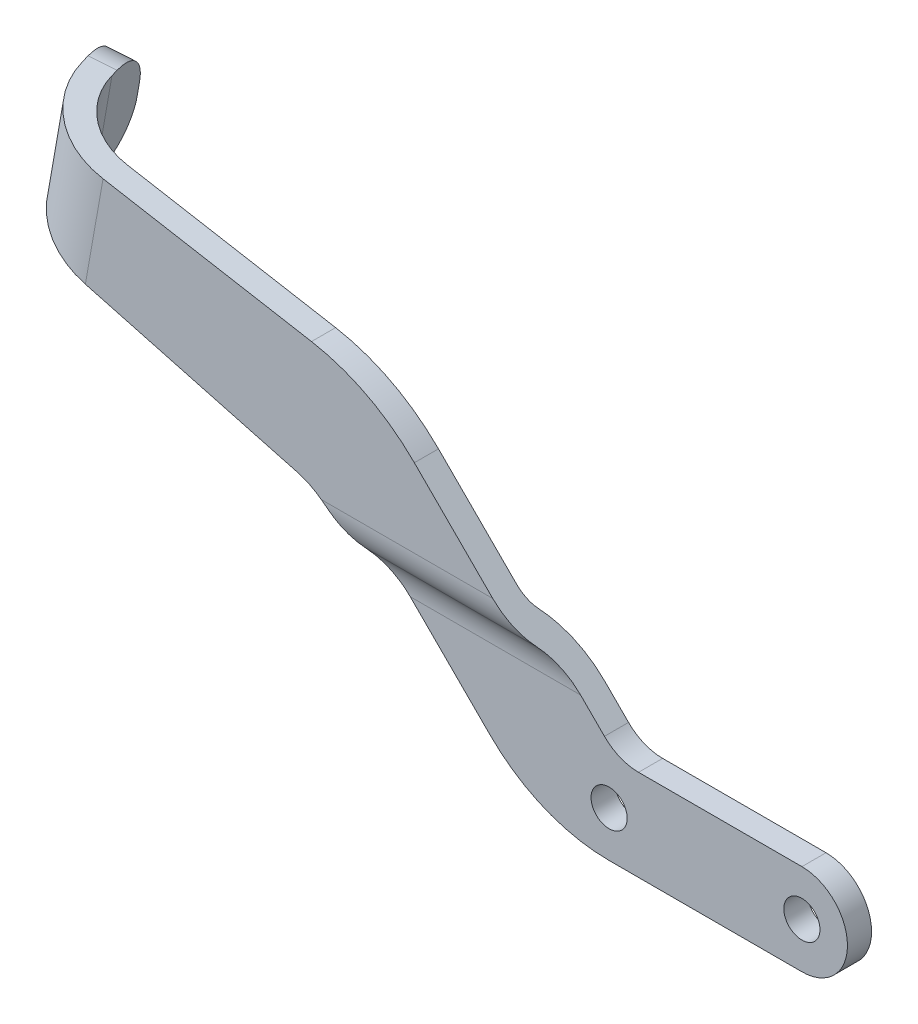
ISO-10303-21;
HEADER;
FILE_DESCRIPTION(('STEP AP214'),'2;1');
FILE_NAME('part.step','',(''),(''),'','','');
FILE_SCHEMA(('AUTOMOTIVE_DESIGN { 1 0 10303 214 1 1 1 1 }'));
ENDSEC;
DATA;
#1=APPLICATION_CONTEXT('core data for automotive mechanical design processes');
#2=APPLICATION_PROTOCOL_DEFINITION('international standard','automotive_design',2000,#1);
#3=PRODUCT_CONTEXT('',#1,'mechanical');
#4=PRODUCT('Part','Part','',(#3));
#5=PRODUCT_RELATED_PRODUCT_CATEGORY('part','',(#4));
#6=PRODUCT_DEFINITION_FORMATION('','',#4);
#7=PRODUCT_DEFINITION_CONTEXT('part definition',#1,'design');
#8=PRODUCT_DEFINITION('design','',#6,#7);
#9=PRODUCT_DEFINITION_SHAPE('','',#8);
#10=(LENGTH_UNIT() NAMED_UNIT(*) SI_UNIT(.MILLI.,.METRE.));
#11=(NAMED_UNIT(*) PLANE_ANGLE_UNIT() SI_UNIT($,.RADIAN.));
#12=(NAMED_UNIT(*) SI_UNIT($,.STERADIAN.) SOLID_ANGLE_UNIT());
#13=UNCERTAINTY_MEASURE_WITH_UNIT(LENGTH_MEASURE(1.E-05),#10,'distance_accuracy_value','');
#14=(GEOMETRIC_REPRESENTATION_CONTEXT(3) GLOBAL_UNCERTAINTY_ASSIGNED_CONTEXT((#13)) GLOBAL_UNIT_ASSIGNED_CONTEXT((#10,
#11,#12)) REPRESENTATION_CONTEXT('',''));
#15=CARTESIAN_POINT('',(0.,0.,0.));
#16=DIRECTION('',(0.,0.,1.));
#17=DIRECTION('',(1.,0.,0.));
#18=AXIS2_PLACEMENT_3D('',#15,#16,#17);
#19=CARTESIAN_POINT('',(-26.0151280605346,7.85987193946543,-3.175));
#20=DIRECTION('',(-0.707106781186549,-0.707106781186546,0.));
#21=DIRECTION('',(0.707106781186546,-0.707106781186549,0.));
#22=AXIS2_PLACEMENT_3D('',#19,#20,#21);
#23=PLANE('',#22);
#24=CARTESIAN_POINT('',(-29.1549957084391,10.9997395873699,6.35));
#25=DIRECTION('',(0.707106781186549,0.707106781186546,0.));
#26=DIRECTION('',(0.707106781186546,-0.707106781186549,0.));
#27=AXIS2_PLACEMENT_3D('',#24,#25,#26);
#28=ELLIPSE('',#27,13.4703841816037,9.525);
#29=CARTESIAN_POINT('',(-29.1549957084391,10.9997395873699,-3.175));
#30=VERTEX_POINT('',#29);
#31=CARTESIAN_POINT('',(-35.4551910179116,17.2999348968425,-0.793750000000002));
#32=VERTEX_POINT('',#31);
#33=EDGE_CURVE('E258',#30,#32,#28,.T.);
#34=ORIENTED_EDGE('',*,*,#33,.T.);
#35=CARTESIAN_POINT('',(-37.5552561210691,19.4,-3.175));
#36=DIRECTION('',(0.707106781186549,0.707106781186546,0.));
#37=DIRECTION('',(0.707106781186546,-0.707106781186549,0.));
#38=AXIS2_PLACEMENT_3D('',#35,#36,#37);
#39=ELLIPSE('',#38,4.49012806053457,3.175);
#40=CARTESIAN_POINT('',(-37.5552561210691,19.4,0.));
#41=VERTEX_POINT('',#40);
#42=EDGE_CURVE('E270',#32,#41,#39,.F.);
#43=ORIENTED_EDGE('',*,*,#42,.T.);
#44=DIRECTION('',(0.707106781186546,-0.707106781186549,0.));
#45=VECTOR('',#44,1.);
#46=CARTESIAN_POINT('',(-26.0151280605346,7.85987193946543,0.));
#47=LINE('',#46,#45);
#48=CARTESIAN_POINT('',(-47.8835482141741,29.728292093105,0.));
#49=VERTEX_POINT('',#48);
#50=EDGE_CURVE('E552',#49,#41,#47,.T.);
#51=ORIENTED_EDGE('',*,*,#50,.F.);
#52=DIRECTION('',(0.,0.,1.));
#53=VECTOR('',#52,1.);
#54=CARTESIAN_POINT('',(-47.8835482141741,29.728292093105,-3.175));
#55=LINE('',#54,#53);
#56=CARTESIAN_POINT('',(-47.8835482141741,29.728292093105,3.175));
#57=VERTEX_POINT('',#56);
#58=EDGE_CURVE('E450',#49,#57,#55,.T.);
#59=ORIENTED_EDGE('',*,*,#58,.T.);
#60=DIRECTION('',(-0.707106781186546,0.707106781186549,0.));
#61=VECTOR('',#60,1.);
#62=CARTESIAN_POINT('',(-26.0151280605346,7.85987193946543,3.175));
#63=LINE('',#62,#61);
#64=CARTESIAN_POINT('',(-37.5552561210691,19.4,3.175));
#65=VERTEX_POINT('',#64);
#66=EDGE_CURVE('E438',#65,#57,#63,.T.);
#67=ORIENTED_EDGE('',*,*,#66,.F.);
#68=CARTESIAN_POINT('',(-37.5552561210691,19.4,-3.175));
#69=DIRECTION('',(0.707106781186549,0.707106781186546,0.));
#70=DIRECTION('',(-0.707106781186546,0.707106781186549,0.));
#71=AXIS2_PLACEMENT_3D('',#68,#69,#70);
#72=ELLIPSE('',#71,8.98025612106914,6.35);
#73=CARTESIAN_POINT('',(-33.3551259147541,15.199869793685,1.5875));
#74=VERTEX_POINT('',#73);
#75=EDGE_CURVE('E295',#74,#65,#72,.F.);
#76=ORIENTED_EDGE('',*,*,#75,.F.);
#77=CARTESIAN_POINT('',(-29.1549957084391,10.9997395873699,6.35));
#78=DIRECTION('',(0.707106781186549,0.707106781186546,0.));
#79=DIRECTION('',(-0.707106781186546,0.707106781186549,0.));
#80=AXIS2_PLACEMENT_3D('',#77,#78,#79);
#81=ELLIPSE('',#80,8.98025612106914,6.35);
#82=CARTESIAN_POINT('',(-29.1549957084391,10.9997395873699,0.));
#83=VERTEX_POINT('',#82);
#84=EDGE_CURVE('E430',#83,#74,#81,.T.);
#85=ORIENTED_EDGE('',*,*,#84,.F.);
#86=DIRECTION('',(-0.707106781186546,0.707106781186549,0.));
#87=VECTOR('',#86,1.);
#88=CARTESIAN_POINT('',(-26.0151280605346,7.85987193946543,0.));
#89=LINE('',#88,#87);
#90=CARTESIAN_POINT('',(-26.0151280605346,7.85987193946543,0.));
#91=VERTEX_POINT('',#90);
#92=EDGE_CURVE('E526',#91,#83,#89,.T.);
#93=ORIENTED_EDGE('',*,*,#92,.F.);
#94=DIRECTION('',(0.,0.,1.));
#95=VECTOR('',#94,1.);
#96=CARTESIAN_POINT('',(-26.0151280605346,7.85987193946543,-3.175));
#97=LINE('',#96,#95);
#98=CARTESIAN_POINT('',(-26.0151280605346,7.85987193946543,-3.175));
#99=VERTEX_POINT('',#98);
#100=EDGE_CURVE('E411',#99,#91,#97,.T.);
#101=ORIENTED_EDGE('',*,*,#100,.F.);
#102=DIRECTION('',(-0.707106781186546,0.707106781186549,0.));
#103=VECTOR('',#102,1.);
#104=CARTESIAN_POINT('',(-26.0151280605346,7.85987193946543,-3.175));
#105=LINE('',#104,#103);
#106=EDGE_CURVE('E408',#99,#30,#105,.T.);
#107=ORIENTED_EDGE('',*,*,#106,.T.);
#108=EDGE_LOOP('',(#34,#43,#51,#59,#67,#76,#85,#93,#101,#107));
#109=FACE_BOUND('',#108,.T.);
#110=ADVANCED_FACE('F45',(#109),#23,.F.);
#111=CARTESIAN_POINT('',(-65.8440604563124,11.7677798509667,-3.175));
#112=DIRECTION('',(0.,0.,1.));
#113=DIRECTION('',(-1.,0.,0.));
#114=AXIS2_PLACEMENT_3D('',#111,#112,#113);
#115=CYLINDRICAL_SURFACE('',#114,9.52500000000001);
#116=DIRECTION('',(0.,0.,1.));
#117=VECTOR('',#116,1.);
#118=CARTESIAN_POINT('',(-59.1088683655106,18.5029719417686,-3.175));
#119=LINE('',#118,#117);
#120=CARTESIAN_POINT('',(-59.1088683655106,18.5029719417686,-0.129352997679215));
#121=VERTEX_POINT('',#120);
#122=CARTESIAN_POINT('',(-59.1088683655106,18.5029719417686,3.1113217116805));
#123=VERTEX_POINT('',#122);
#124=EDGE_CURVE('E458',#121,#123,#119,.T.);
#125=ORIENTED_EDGE('',*,*,#124,.T.);
#126=CARTESIAN_POINT('',(-59.1088683655106,18.5029719417686,3.1113217116805));
#127=CARTESIAN_POINT('',(-59.189505151597,18.583613825167,3.12282841350219));
#128=CARTESIAN_POINT('',(-59.2717146733717,18.6629219050843,3.13256262496471));
#129=CARTESIAN_POINT('',(-59.4389441454381,18.818532451764,3.14880457763691));
#130=CARTESIAN_POINT('',(-59.5239583882968,18.8948404041585,3.15531848630597));
#131=CARTESIAN_POINT('',(-59.6967706565378,19.044421600127,3.16547983513595));
#132=CARTESIAN_POINT('',(-59.7845685842799,19.1176949499349,3.16912737572188));
#133=CARTESIAN_POINT('',(-59.9629595247646,19.2612047935532,3.17388938858678));
#134=CARTESIAN_POINT('',(-60.0535575957453,19.3314351657777,3.17499896803526));
#135=CARTESIAN_POINT('',(-60.1453903836823,19.4,3.175));
#136=B_SPLINE_CURVE_WITH_KNOTS('',3,(#126,#127,#128,#129,#130,#131,#132,#133,#134,#135),
.UNSPECIFIED.,.F.,.F.,(4,2,2,2,4),(0.,0.343814559628881,0.686968076684379,1.03010957060628,
1.37391203728518),.UNSPECIFIED.);
#137=CARTESIAN_POINT('',(-60.1453903836823,19.4,3.175));
#138=VERTEX_POINT('',#137);
#139=EDGE_CURVE('E287',#123,#138,#136,.T.);
#140=ORIENTED_EDGE('',*,*,#139,.T.);
#141=CARTESIAN_POINT('',(-65.8440604563124,11.7677798509667,3.175));
#142=DIRECTION('',(0.,0.,1.));
#143=DIRECTION('',(1.,0.,0.));
#144=AXIS2_PLACEMENT_3D('',#141,#142,#143);
#145=CIRCLE('',#144,9.52500000000001);
#146=CARTESIAN_POINT('',(-63.3788090517109,20.9682233463701,3.175));
#147=VERTEX_POINT('',#146);
#148=EDGE_CURVE('E427',#138,#147,#145,.T.);
#149=ORIENTED_EDGE('',*,*,#148,.T.);
#150=DIRECTION('',(0.,0.,1.));
#151=VECTOR('',#150,1.);
#152=CARTESIAN_POINT('',(-63.3788090517109,20.9682233463701,-3.175));
#153=LINE('',#152,#151);
#154=CARTESIAN_POINT('',(-63.3788090517109,20.9682233463701,0.));
#155=VERTEX_POINT('',#154);
#156=EDGE_CURVE('E456',#155,#147,#153,.T.);
#157=ORIENTED_EDGE('',*,*,#156,.F.);
#158=CARTESIAN_POINT('',(-65.8440604563124,11.7677798509667,0.));
#159=DIRECTION('',(0.,0.,-1.));
#160=DIRECTION('',(-1.,0.,0.));
#161=AXIS2_PLACEMENT_3D('',#158,#159,#160);
#162=CIRCLE('',#161,9.52500000000001);
#163=CARTESIAN_POINT('',(-60.1453903836823,19.4,0.));
#164=VERTEX_POINT('',#163);
#165=EDGE_CURVE('E477',#155,#164,#162,.T.);
#166=ORIENTED_EDGE('',*,*,#165,.T.);
#167=CARTESIAN_POINT('',(-59.1088683655106,18.5029719417686,-0.129352997679214));
#168=CARTESIAN_POINT('',(-59.1886792418234,18.5828004142644,-0.105848736286279));
#169=CARTESIAN_POINT('',(-59.2704318916558,18.6616980958661,-0.0860128643272615));
#170=CARTESIAN_POINT('',(-59.4371062268742,18.8168516372428,-0.053007404663316));
#171=CARTESIAN_POINT('',(-59.5220143189027,18.893116595117,-0.0398121361289758));
#172=CARTESIAN_POINT('',(-59.6948995496534,19.0428422283832,-0.0192473264905239));
#173=CARTESIAN_POINT('',(-59.7828761994638,19.1163033466386,-0.0118768617102921));
#174=CARTESIAN_POINT('',(-59.9619463224182,19.2604195171152,-0.00224620935788169));
#175=CARTESIAN_POINT('',(-60.0530506400862,19.3310624707226,-6.12148140675001E-06));
#176=CARTESIAN_POINT('',(-60.1453903836823,19.4,0.));
#177=B_SPLINE_CURVE_WITH_KNOTS('',3,(#167,#168,#169,#170,#171,#172,#173,#174,#175,#176),
.UNSPECIFIED.,.F.,.F.,(4,2,2,2,4),(0.,0.345762616395283,0.690177606879254,1.03453797032589,
1.38024517136542),.UNSPECIFIED.);
#178=EDGE_CURVE('E261',#121,#164,#177,.T.);
#179=ORIENTED_EDGE('',*,*,#178,.F.);
#180=EDGE_LOOP('',(#125,#140,#149,#157,#166,#179));
#181=FACE_BOUND('',#180,.T.);
#182=ADVANCED_FACE('F276',(#181),#115,.F.);
#183=CARTESIAN_POINT('',(-59.1088683655106,18.5029719417686,-3.175));
#184=DIRECTION('',(0.707106781186549,0.707106781186546,0.));
#185=DIRECTION('',(-0.707106781186546,0.707106781186549,0.));
#186=AXIS2_PLACEMENT_3D('',#183,#184,#185);
#187=PLANE('',#186);
#188=CARTESIAN_POINT('',(-60.005896423742,19.4,-3.175));
#189=DIRECTION('',(-0.707106781186549,-0.707106781186546,0.));
#190=DIRECTION('',(0.707106781186546,-0.707106781186549,0.));
#191=AXIS2_PLACEMENT_3D('',#188,#189,#190);
#192=ELLIPSE('',#191,4.49012806053456,3.175);
#193=CARTESIAN_POINT('',(-57.9058313205844,17.2999348968425,-0.793750000000002));
#194=VERTEX_POINT('',#193);
#195=EDGE_CURVE('E474',#121,#194,#192,.F.);
#196=ORIENTED_EDGE('',*,*,#195,.T.);
#197=CARTESIAN_POINT('',(-51.6056360111119,10.9997395873699,6.35));
#198=DIRECTION('',(-0.707106781186549,-0.707106781186546,0.));
#199=DIRECTION('',(0.707106781186546,-0.707106781186549,0.));
#200=AXIS2_PLACEMENT_3D('',#197,#198,#199);
#201=ELLIPSE('',#200,13.4703841816037,9.525);
#202=CARTESIAN_POINT('',(-51.6056360111119,10.9997395873699,-3.175));
#203=VERTEX_POINT('',#202);
#204=EDGE_CURVE('E255',#194,#203,#201,.T.);
#205=ORIENTED_EDGE('',*,*,#204,.T.);
#206=DIRECTION('',(0.707106781186546,-0.707106781186549,0.));
#207=VECTOR('',#206,1.);
#208=CARTESIAN_POINT('',(-59.1088683655106,18.5029719417686,-3.175));
#209=LINE('',#208,#207);
#210=CARTESIAN_POINT('',(-41.115448211871,0.509551788129007,-3.175));
#211=VERTEX_POINT('',#210);
#212=EDGE_CURVE('E415',#203,#211,#209,.T.);
#213=ORIENTED_EDGE('',*,*,#212,.T.);
#214=DIRECTION('',(0.,0.,1.));
#215=VECTOR('',#214,1.);
#216=CARTESIAN_POINT('',(-41.115448211871,0.509551788129007,-3.175));
#217=LINE('',#216,#215);
#218=CARTESIAN_POINT('',(-41.115448211871,0.509551788129007,0.));
#219=VERTEX_POINT('',#218);
#220=EDGE_CURVE('E461',#211,#219,#217,.T.);
#221=ORIENTED_EDGE('',*,*,#220,.T.);
#222=DIRECTION('',(0.707106781186546,-0.707106781186549,0.));
#223=VECTOR('',#222,1.);
#224=CARTESIAN_POINT('',(-59.1088683655106,18.5029719417686,0.));
#225=LINE('',#224,#223);
#226=CARTESIAN_POINT('',(-51.6056360111119,10.9997395873699,0.));
#227=VERTEX_POINT('',#226);
#228=EDGE_CURVE('E519',#227,#219,#225,.T.);
#229=ORIENTED_EDGE('',*,*,#228,.F.);
#230=CARTESIAN_POINT('',(-51.6056360111119,10.9997395873699,6.35));
#231=DIRECTION('',(-0.707106781186549,-0.707106781186546,0.));
#232=DIRECTION('',(-0.707106781186546,0.707106781186549,0.));
#233=AXIS2_PLACEMENT_3D('',#230,#231,#232);
#234=ELLIPSE('',#233,8.98025612106913,6.35);
#235=CARTESIAN_POINT('',(-55.8057662174269,15.199869793685,1.5875));
#236=VERTEX_POINT('',#235);
#237=EDGE_CURVE('E470',#236,#227,#234,.T.);
#238=ORIENTED_EDGE('',*,*,#237,.F.);
#239=CARTESIAN_POINT('',(-60.005896423742,19.4,-3.175));
#240=DIRECTION('',(-0.707106781186549,-0.707106781186546,0.));
#241=DIRECTION('',(-0.707106781186546,0.707106781186549,0.));
#242=AXIS2_PLACEMENT_3D('',#239,#240,#241);
#243=ELLIPSE('',#242,8.98025612106913,6.35);
#244=EDGE_CURVE('E296',#123,#236,#243,.F.);
#245=ORIENTED_EDGE('',*,*,#244,.F.);
#246=ORIENTED_EDGE('',*,*,#124,.F.);
#247=EDGE_LOOP('',(#196,#205,#213,#221,#229,#238,#245,#246));
#248=FACE_BOUND('',#247,.T.);
#249=ADVANCED_FACE('F281',(#248),#187,.F.);
#250=CARTESIAN_POINT('',(0.,0.,-3.175));
#251=DIRECTION('',(0.,0.,1.));
#252=DIRECTION('',(-1.,0.,0.));
#253=AXIS2_PLACEMENT_3D('',#250,#251,#252);
#254=PLANE('',#253);
#255=CARTESIAN_POINT('',(-25.4,0.,-3.175));
#256=DIRECTION('',(0.,0.,1.));
#257=DIRECTION('',(1.,0.,0.));
#258=AXIS2_PLACEMENT_3D('',#255,#256,#257);
#259=CIRCLE('',#258,2.38125);
#260=CARTESIAN_POINT('',(-23.01875,0.,-3.175));
#261=VERTEX_POINT('',#260);
#262=EDGE_CURVE('E223',#261,#261,#259,.T.);
#263=ORIENTED_EDGE('',*,*,#262,.T.);
#264=EDGE_LOOP('',(#263));
#265=FACE_BOUND('',#264,.T.);
#266=CARTESIAN_POINT('',(0.,0.,-3.175));
#267=DIRECTION('',(0.,0.,1.));
#268=DIRECTION('',(1.,0.,0.));
#269=AXIS2_PLACEMENT_3D('',#266,#267,#268);
#270=CIRCLE('',#269,2.38125);
#271=CARTESIAN_POINT('',(2.38125,0.,-3.175));
#272=VERTEX_POINT('',#271);
#273=EDGE_CURVE('E247',#272,#272,#270,.T.);
#274=ORIENTED_EDGE('',*,*,#273,.T.);
#275=EDGE_LOOP('',(#274));
#276=FACE_BOUND('',#275,.T.);
#277=DIRECTION('',(1.,0.,0.));
#278=VECTOR('',#277,1.);
#279=CARTESIAN_POINT('',(-91.2266301851405,10.9997395873699,-3.175));
#280=LINE('',#279,#278);
#281=EDGE_CURVE('E400',#203,#30,#280,.T.);
#282=ORIENTED_EDGE('',*,*,#281,.T.);
#283=ORIENTED_EDGE('',*,*,#106,.F.);
#284=CARTESIAN_POINT('',(-21.525,12.35,-3.175));
#285=DIRECTION('',(0.,0.,1.));
#286=DIRECTION('',(1.,0.,0.));
#287=AXIS2_PLACEMENT_3D('',#284,#285,#286);
#288=CIRCLE('',#287,6.35);
#289=CARTESIAN_POINT('',(-21.525,6.,-3.175));
#290=VERTEX_POINT('',#289);
#291=EDGE_CURVE('E414',#99,#290,#288,.T.);
#292=ORIENTED_EDGE('',*,*,#291,.T.);
#293=DIRECTION('',(-1.,0.,0.));
#294=VECTOR('',#293,1.);
#295=CARTESIAN_POINT('',(0.,6.,-3.175));
#296=LINE('',#295,#294);
#297=CARTESIAN_POINT('',(0.,6.,-3.175));
#298=VERTEX_POINT('',#297);
#299=EDGE_CURVE('E417',#298,#290,#296,.T.);
#300=ORIENTED_EDGE('',*,*,#299,.F.);
#301=CARTESIAN_POINT('',(0.,0.,-3.175));
#302=DIRECTION('',(0.,0.,-1.));
#303=DIRECTION('',(-1.,0.,0.));
#304=AXIS2_PLACEMENT_3D('',#301,#302,#303);
#305=CIRCLE('',#304,6.);
#306=CARTESIAN_POINT('',(0.,-6.,-3.175));
#307=VERTEX_POINT('',#306);
#308=EDGE_CURVE('E441',#298,#307,#305,.T.);
#309=ORIENTED_EDGE('',*,*,#308,.T.);
#310=DIRECTION('',(-1.,0.,0.));
#311=VECTOR('',#310,1.);
#312=CARTESIAN_POINT('',(0.,-6.,-3.175));
#313=LINE('',#312,#311);
#314=CARTESIAN_POINT('',(-25.4,-6.,-3.175));
#315=VERTEX_POINT('',#314);
#316=EDGE_CURVE('E531',#307,#315,#313,.T.);
#317=ORIENTED_EDGE('',*,*,#316,.T.);
#318=CARTESIAN_POINT('',(-25.4,16.225,-3.175));
#319=DIRECTION('',(0.,0.,-1.));
#320=DIRECTION('',(-1.,0.,0.));
#321=AXIS2_PLACEMENT_3D('',#318,#319,#320);
#322=CIRCLE('',#321,22.225);
#323=EDGE_CURVE('E420',#315,#211,#322,.T.);
#324=ORIENTED_EDGE('',*,*,#323,.T.);
#325=ORIENTED_EDGE('',*,*,#212,.F.);
#326=EDGE_LOOP('',(#282,#283,#292,#300,#309,#317,#324,#325));
#327=FACE_BOUND('',#326,.T.);
#328=ADVANCED_FACE('F314',(#265,#276,#327),#254,.F.);
#329=CARTESIAN_POINT('',(0.,0.,-3.175));
#330=DIRECTION('',(0.,0.,1.));
#331=DIRECTION('',(-1.,0.,0.));
#332=AXIS2_PLACEMENT_3D('',#329,#330,#331);
#333=CYLINDRICAL_SURFACE('',#332,6.);
#334=CARTESIAN_POINT('',(0.,0.,0.));
#335=DIRECTION('',(0.,0.,1.));
#336=DIRECTION('',(1.,0.,0.));
#337=AXIS2_PLACEMENT_3D('',#334,#335,#336);
#338=CIRCLE('',#337,6.);
#339=CARTESIAN_POINT('',(0.,6.,0.));
#340=VERTEX_POINT('',#339);
#341=CARTESIAN_POINT('',(0.,-6.,0.));
#342=VERTEX_POINT('',#341);
#343=EDGE_CURVE('E537',#340,#342,#338,.F.);
#344=ORIENTED_EDGE('',*,*,#343,.T.);
#345=DIRECTION('',(0.,0.,1.));
#346=VECTOR('',#345,1.);
#347=CARTESIAN_POINT('',(0.,-6.,-3.175));
#348=LINE('',#347,#346);
#349=EDGE_CURVE('E426',#307,#342,#348,.T.);
#350=ORIENTED_EDGE('',*,*,#349,.F.);
#351=ORIENTED_EDGE('',*,*,#308,.F.);
#352=DIRECTION('',(0.,0.,1.));
#353=VECTOR('',#352,1.);
#354=CARTESIAN_POINT('',(0.,6.,-3.175));
#355=LINE('',#354,#353);
#356=EDGE_CURVE('E442',#298,#340,#355,.T.);
#357=ORIENTED_EDGE('',*,*,#356,.T.);
#358=EDGE_LOOP('',(#344,#350,#351,#357));
#359=FACE_BOUND('',#358,.T.);
#360=ADVANCED_FACE('F317',(#359),#333,.T.);
#361=CARTESIAN_POINT('',(0.,6.,-3.175));
#362=DIRECTION('',(0.,-1.,0.));
#363=DIRECTION('',(1.,0.,0.));
#364=AXIS2_PLACEMENT_3D('',#361,#362,#363);
#365=PLANE('',#364);
#366=ORIENTED_EDGE('',*,*,#356,.F.);
#367=ORIENTED_EDGE('',*,*,#299,.T.);
#368=DIRECTION('',(0.,0.,1.));
#369=VECTOR('',#368,1.);
#370=CARTESIAN_POINT('',(-21.525,6.,-3.175));
#371=LINE('',#370,#369);
#372=CARTESIAN_POINT('',(-21.525,6.,0.));
#373=VERTEX_POINT('',#372);
#374=EDGE_CURVE('E446',#290,#373,#371,.T.);
#375=ORIENTED_EDGE('',*,*,#374,.T.);
#376=DIRECTION('',(-1.,0.,0.));
#377=VECTOR('',#376,1.);
#378=CARTESIAN_POINT('',(0.,6.,0.));
#379=LINE('',#378,#377);
#380=EDGE_CURVE('E540',#340,#373,#379,.T.);
#381=ORIENTED_EDGE('',*,*,#380,.F.);
#382=EDGE_LOOP('',(#366,#367,#375,#381));
#383=FACE_BOUND('',#382,.T.);
#384=ADVANCED_FACE('F323',(#383),#365,.F.);
#385=CARTESIAN_POINT('',(-21.525,12.35,-3.175));
#386=DIRECTION('',(0.,0.,1.));
#387=DIRECTION('',(-1.,0.,0.));
#388=AXIS2_PLACEMENT_3D('',#385,#386,#387);
#389=CYLINDRICAL_SURFACE('',#388,6.35);
#390=CARTESIAN_POINT('',(-21.525,12.35,0.));
#391=DIRECTION('',(0.,0.,1.));
#392=DIRECTION('',(1.,0.,0.));
#393=AXIS2_PLACEMENT_3D('',#390,#391,#392);
#394=CIRCLE('',#393,6.35);
#395=EDGE_CURVE('E542',#91,#373,#394,.T.);
#396=ORIENTED_EDGE('',*,*,#395,.T.);
#397=ORIENTED_EDGE('',*,*,#374,.F.);
#398=ORIENTED_EDGE('',*,*,#291,.F.);
#399=ORIENTED_EDGE('',*,*,#100,.T.);
#400=EDGE_LOOP('',(#396,#397,#398,#399));
#401=FACE_BOUND('',#400,.T.);
#402=ADVANCED_FACE('F326',(#401),#389,.F.);
#403=CARTESIAN_POINT('',(-65.8440604563124,11.7677798509667,-3.175));
#404=DIRECTION('',(0.,0.,1.));
#405=DIRECTION('',(-1.,0.,0.));
#406=AXIS2_PLACEMENT_3D('',#403,#404,#405);
#407=CYLINDRICAL_SURFACE('',#406,25.4);
#408=DIRECTION('',(0.,0.,1.));
#409=VECTOR('',#408,1.);
#410=CARTESIAN_POINT('',(-61.4333967435724,36.7818967774768,-3.175));
#411=LINE('',#410,#409);
#412=CARTESIAN_POINT('',(-61.4333967435724,36.7818967774768,0.));
#413=VERTEX_POINT('',#412);
#414=CARTESIAN_POINT('',(-61.4333967435724,36.7818967774768,3.175));
#415=VERTEX_POINT('',#414);
#416=EDGE_CURVE('E453',#413,#415,#411,.T.);
#417=ORIENTED_EDGE('',*,*,#416,.T.);
#418=CARTESIAN_POINT('',(-65.8440604563124,11.7677798509667,3.175));
#419=DIRECTION('',(0.,0.,1.));
#420=DIRECTION('',(1.,0.,0.));
#421=AXIS2_PLACEMENT_3D('',#418,#419,#420);
#422=CIRCLE('',#421,25.4);
#423=EDGE_CURVE('E435',#57,#415,#422,.T.);
#424=ORIENTED_EDGE('',*,*,#423,.F.);
#425=ORIENTED_EDGE('',*,*,#58,.F.);
#426=CARTESIAN_POINT('',(-65.8440604563124,11.7677798509667,0.));
#427=DIRECTION('',(0.,0.,-1.));
#428=DIRECTION('',(-1.,0.,0.));
#429=AXIS2_PLACEMENT_3D('',#426,#427,#428);
#430=CIRCLE('',#429,25.4);
#431=EDGE_CURVE('E557',#413,#49,#430,.T.);
#432=ORIENTED_EDGE('',*,*,#431,.F.);
#433=EDGE_LOOP('',(#417,#424,#425,#432));
#434=FACE_BOUND('',#433,.T.);
#435=ADVANCED_FACE('F330',(#434),#407,.T.);
#436=CARTESIAN_POINT('',(-61.4333967435724,36.7818967774768,-3.175));
#437=DIRECTION('',(-0.17364817766693,-0.984807753012208,0.));
#438=DIRECTION('',(0.984807753012208,-0.17364817766693,0.));
#439=AXIS2_PLACEMENT_3D('',#436,#437,#438);
#440=PLANE('',#439);
#441=DIRECTION('',(-0.241580615484602,0.0425971805260925,-0.969445349895139));
#442=VECTOR('',#441,1.);
#443=CARTESIAN_POINT('',(-101.437156596784,43.8356389693801,-6.73547247011678));
#444=LINE('',#443,#442);
#445=CARTESIAN_POINT('',(-101.437156596784,43.8356389693801,-6.73547247011678));
#446=VERTEX_POINT('',#445);
#447=CARTESIAN_POINT('',(-101.658057911583,43.8745898312532,-7.6219332980609));
#448=VERTEX_POINT('',#447);
#449=EDGE_CURVE('E347',#446,#448,#444,.T.);
#450=ORIENTED_EDGE('',*,*,#449,.F.);
#451=CARTESIAN_POINT('',(-88.9,41.625,-9.9568));
#452=DIRECTION('',(-0.17364817766693,-0.984807753012208,0.));
#453=DIRECTION('',(-0.984807753012208,0.17364817766693,0.));
#454=AXIS2_PLACEMENT_3D('',#451,#452,#453);
#455=CIRCLE('',#454,13.1318);
#456=CARTESIAN_POINT('',(-88.9,41.625,3.175));
#457=VERTEX_POINT('',#456);
#458=EDGE_CURVE('E243',#457,#446,#455,.T.);
#459=ORIENTED_EDGE('',*,*,#458,.F.);
#460=DIRECTION('',(-0.984807753012208,0.17364817766693,0.));
#461=VECTOR('',#460,1.);
#462=CARTESIAN_POINT('',(-61.4333967435724,36.7818967774768,3.175));
#463=LINE('',#462,#461);
#464=EDGE_CURVE('E433',#415,#457,#463,.T.);
#465=ORIENTED_EDGE('',*,*,#464,.F.);
#466=ORIENTED_EDGE('',*,*,#416,.F.);
#467=DIRECTION('',(0.984807753012208,-0.17364817766693,0.));
#468=VECTOR('',#467,1.);
#469=CARTESIAN_POINT('',(-61.4333967435724,36.7818967774768,0.));
#470=LINE('',#469,#468);
#471=CARTESIAN_POINT('',(-88.9,41.625,0.));
#472=VERTEX_POINT('',#471);
#473=EDGE_CURVE('E559',#472,#413,#470,.T.);
#474=ORIENTED_EDGE('',*,*,#473,.F.);
#475=CARTESIAN_POINT('',(-88.9,41.625,-9.9568));
#476=DIRECTION('',(-0.17364817766693,-0.984807753012208,0.));
#477=DIRECTION('',(-0.984807753012208,0.17364817766693,0.));
#478=AXIS2_PLACEMENT_3D('',#475,#476,#477);
#479=CIRCLE('',#478,9.95679999999999);
#480=CARTESIAN_POINT('',(-98.4059291797663,43.3011517910967,-7.51432342028197));
#481=VERTEX_POINT('',#480);
#482=EDGE_CURVE('E228',#472,#481,#479,.T.);
#483=ORIENTED_EDGE('',*,*,#482,.T.);
#484=DIRECTION('',(0.241580615484602,-0.0425971805260914,0.969445349895139));
#485=VECTOR('',#484,1.);
#486=CARTESIAN_POINT('',(-99.9154214975603,43.567316013896,-13.5718057445668));
#487=LINE('',#486,#485);
#488=CARTESIAN_POINT('',(-98.6268304945654,43.3401026529698,-8.40078424822609));
#489=VERTEX_POINT('',#488);
#490=EDGE_CURVE('E211',#489,#481,#487,.T.);
#491=ORIENTED_EDGE('',*,*,#490,.F.);
#492=DIRECTION('',(0.954717296698367,-0.168342418356971,-0.245307385878799));
#493=VECTOR('',#492,1.);
#494=CARTESIAN_POINT('',(-98.6268304945654,43.3401026529698,-8.40078424822608));
#495=LINE('',#494,#493);
#496=EDGE_CURVE('E350',#448,#489,#495,.T.);
#497=ORIENTED_EDGE('',*,*,#496,.F.);
#498=EDGE_LOOP('',(#450,#459,#465,#466,#474,#483,#491,#497));
#499=FACE_BOUND('',#498,.T.);
#500=ADVANCED_FACE('F336',(#499),#440,.F.);
#501=CARTESIAN_POINT('',(-63.3788090517109,20.9682233463701,-3.175));
#502=DIRECTION('',(-0.258819045102521,-0.965925826289068,0.));
#503=DIRECTION('',(0.965925826289068,-0.258819045102521,0.));
#504=AXIS2_PLACEMENT_3D('',#501,#502,#503);
#505=PLANE('',#504);
#506=DIRECTION('',(0.237799086154686,-0.0637180730960073,0.969222163275752));
#507=VECTOR('',#506,1.);
#508=CARTESIAN_POINT('',(-101.957856591592,31.3054479794431,-13.1060863516145));
#509=LINE('',#508,#507);
#510=CARTESIAN_POINT('',(-100.830533645396,31.0033827064008,-8.51134041591392));
#511=VERTEX_POINT('',#510);
#512=CARTESIAN_POINT('',(-100.585915084837,30.9378373606455,-7.51432342028197));
#513=VERTEX_POINT('',#512);
#514=EDGE_CURVE('E209',#511,#513,#509,.T.);
#515=ORIENTED_EDGE('',*,*,#514,.T.);
#516=CARTESIAN_POINT('',(-91.2266301851405,28.4300245300389,-9.9568));
#517=DIRECTION('',(0.258819045102521,0.965925826289068,0.));
#518=DIRECTION('',(-0.965925826289068,0.258819045102521,0.));
#519=AXIS2_PLACEMENT_3D('',#516,#517,#518);
#520=ELLIPSE('',#519,9.9948333584516,9.95679999999999);
#521=CARTESIAN_POINT('',(-91.2266301851405,28.4300245300389,0.));
#522=VERTEX_POINT('',#521);
#523=EDGE_CURVE('E218',#522,#513,#520,.F.);
#524=ORIENTED_EDGE('',*,*,#523,.F.);
#525=DIRECTION('',(0.965925826289068,-0.258819045102521,0.));
#526=VECTOR('',#525,1.);
#527=CARTESIAN_POINT('',(-63.3788090517109,20.9682233463701,0.));
#528=LINE('',#527,#526);
#529=EDGE_CURVE('E561',#522,#155,#528,.T.);
#530=ORIENTED_EDGE('',*,*,#529,.T.);
#531=ORIENTED_EDGE('',*,*,#156,.T.);
#532=DIRECTION('',(-0.965925826289068,0.258819045102521,0.));
#533=VECTOR('',#532,1.);
#534=CARTESIAN_POINT('',(-63.3788090517109,20.9682233463701,3.175));
#535=LINE('',#534,#533);
#536=CARTESIAN_POINT('',(-91.2266301851405,28.4300245300389,3.175));
#537=VERTEX_POINT('',#536);
#538=EDGE_CURVE('E358',#147,#537,#535,.T.);
#539=ORIENTED_EDGE('',*,*,#538,.T.);
#540=CARTESIAN_POINT('',(-91.2266301851405,28.4300245300389,-9.9568));
#541=DIRECTION('',(0.258819045102521,0.965925826289068,0.));
#542=DIRECTION('',(-0.965925826289068,0.258819045102521,0.));
#543=AXIS2_PLACEMENT_3D('',#540,#541,#542);
#544=ELLIPSE('',#543,13.1819613426517,13.1318);
#545=CARTESIAN_POINT('',(-103.570380932955,31.7375225744868,-6.73547247011678));
#546=VERTEX_POINT('',#545);
#547=EDGE_CURVE('E240',#537,#546,#544,.F.);
#548=ORIENTED_EDGE('',*,*,#547,.T.);
#549=DIRECTION('',(-0.237799086154687,0.0637180730960074,-0.969222163275752));
#550=VECTOR('',#549,1.);
#551=CARTESIAN_POINT('',(-103.455426691861,31.7067206784192,-6.2669416610528));
#552=LINE('',#551,#550);
#553=CARTESIAN_POINT('',(-103.814999493513,31.8030679202422,-7.73248946574873));
#554=VERTEX_POINT('',#553);
#555=EDGE_CURVE('E232',#546,#554,#552,.T.);
#556=ORIENTED_EDGE('',*,*,#555,.T.);
#557=DIRECTION('',(0.936626392077294,-0.250968285366787,-0.244429788291702));
#558=VECTOR('',#557,1.);
#559=CARTESIAN_POINT('',(-66.8380953692562,21.8951363215444,-17.3822889196476));
#560=LINE('',#559,#558);
#561=EDGE_CURVE('E11',#511,#554,#560,.F.);
#562=ORIENTED_EDGE('',*,*,#561,.F.);
#563=EDGE_LOOP('',(#515,#524,#530,#531,#539,#548,#556,#562));
#564=FACE_BOUND('',#563,.T.);
#565=ADVANCED_FACE('F226',(#564),#505,.T.);
#566=CARTESIAN_POINT('',(-25.4,16.225,-3.175));
#567=DIRECTION('',(0.,0.,1.));
#568=DIRECTION('',(-1.,0.,0.));
#569=AXIS2_PLACEMENT_3D('',#566,#567,#568);
#570=CYLINDRICAL_SURFACE('',#569,22.225);
#571=CARTESIAN_POINT('',(-25.4,16.225,0.));
#572=DIRECTION('',(0.,0.,1.));
#573=DIRECTION('',(1.,0.,0.));
#574=AXIS2_PLACEMENT_3D('',#571,#572,#573);
#575=CIRCLE('',#574,22.225);
#576=CARTESIAN_POINT('',(-25.4,-6.,0.));
#577=VERTEX_POINT('',#576);
#578=EDGE_CURVE('E515',#577,#219,#575,.F.);
#579=ORIENTED_EDGE('',*,*,#578,.T.);
#580=ORIENTED_EDGE('',*,*,#220,.F.);
#581=ORIENTED_EDGE('',*,*,#323,.F.);
#582=DIRECTION('',(0.,0.,1.));
#583=VECTOR('',#582,1.);
#584=CARTESIAN_POINT('',(-25.4,-6.,-3.175));
#585=LINE('',#584,#583);
#586=EDGE_CURVE('E464',#315,#577,#585,.T.);
#587=ORIENTED_EDGE('',*,*,#586,.T.);
#588=EDGE_LOOP('',(#579,#580,#581,#587));
#589=FACE_BOUND('',#588,.T.);
#590=ADVANCED_FACE('F343',(#589),#570,.T.);
#591=CARTESIAN_POINT('',(0.,-6.,-3.175));
#592=DIRECTION('',(0.,-1.,0.));
#593=DIRECTION('',(1.,0.,0.));
#594=AXIS2_PLACEMENT_3D('',#591,#592,#593);
#595=PLANE('',#594);
#596=DIRECTION('',(-1.,0.,0.));
#597=VECTOR('',#596,1.);
#598=CARTESIAN_POINT('',(135.562950910719,-6.,0.));
#599=LINE('',#598,#597);
#600=EDGE_CURVE('E550',#342,#577,#599,.T.);
#601=ORIENTED_EDGE('',*,*,#600,.T.);
#602=ORIENTED_EDGE('',*,*,#586,.F.);
#603=ORIENTED_EDGE('',*,*,#316,.F.);
#604=ORIENTED_EDGE('',*,*,#349,.T.);
#605=EDGE_LOOP('',(#601,#602,#603,#604));
#606=FACE_BOUND('',#605,.T.);
#607=ADVANCED_FACE('F321',(#606),#595,.T.);
#608=CARTESIAN_POINT('',(0.,0.,3.175));
#609=DIRECTION('',(0.,0.,1.));
#610=DIRECTION('',(-1.,0.,0.));
#611=AXIS2_PLACEMENT_3D('',#608,#609,#610);
#612=PLANE('',#611);
#613=DIRECTION('',(-1.,0.,0.));
#614=VECTOR('',#613,1.);
#615=CARTESIAN_POINT('',(135.562950910719,19.4,3.175));
#616=LINE('',#615,#614);
#617=EDGE_CURVE('E445',#138,#65,#616,.F.);
#618=ORIENTED_EDGE('',*,*,#617,.T.);
#619=ORIENTED_EDGE('',*,*,#66,.T.);
#620=ORIENTED_EDGE('',*,*,#423,.T.);
#621=ORIENTED_EDGE('',*,*,#464,.T.);
#622=DIRECTION('',(0.173648177666931,0.984807753012208,0.));
#623=VECTOR('',#622,1.);
#624=CARTESIAN_POINT('',(-91.2266301851405,28.4300245300389,3.175));
#625=LINE('',#624,#623);
#626=EDGE_CURVE('E361',#537,#457,#625,.T.);
#627=ORIENTED_EDGE('',*,*,#626,.F.);
#628=ORIENTED_EDGE('',*,*,#538,.F.);
#629=ORIENTED_EDGE('',*,*,#148,.F.);
#630=EDGE_LOOP('',(#618,#619,#620,#621,#627,#628,#629));
#631=FACE_BOUND('',#630,.T.);
#632=ADVANCED_FACE('F309',(#631),#612,.T.);
#633=CARTESIAN_POINT('',(135.562950910719,10.9997395873699,6.35));
#634=DIRECTION('',(-1.,0.,0.));
#635=DIRECTION('',(0.,0.,-1.));
#636=AXIS2_PLACEMENT_3D('',#633,#634,#635);
#637=CYLINDRICAL_SURFACE('',#636,6.35);
#638=ORIENTED_EDGE('',*,*,#84,.T.);
#639=DIRECTION('',(-1.,0.,0.));
#640=VECTOR('',#639,1.);
#641=CARTESIAN_POINT('',(135.562950910719,15.199869793685,1.5875));
#642=LINE('',#641,#640);
#643=EDGE_CURVE('E548',#74,#236,#642,.T.);
#644=ORIENTED_EDGE('',*,*,#643,.T.);
#645=ORIENTED_EDGE('',*,*,#237,.T.);
#646=DIRECTION('',(-1.,0.,0.));
#647=VECTOR('',#646,1.);
#648=CARTESIAN_POINT('',(135.562950910719,10.9997395873699,0.));
#649=LINE('',#648,#647);
#650=EDGE_CURVE('E523',#83,#227,#649,.T.);
#651=ORIENTED_EDGE('',*,*,#650,.F.);
#652=EDGE_LOOP('',(#638,#644,#645,#651));
#653=FACE_BOUND('',#652,.T.);
#654=ADVANCED_FACE('F306',(#653),#637,.F.);
#655=CARTESIAN_POINT('',(135.562950910719,-6.,0.));
#656=DIRECTION('',(0.,0.,-1.));
#657=DIRECTION('',(1.,0.,0.));
#658=AXIS2_PLACEMENT_3D('',#655,#656,#657);
#659=PLANE('',#658);
#660=CARTESIAN_POINT('',(-25.4,0.,0.));
#661=DIRECTION('',(0.,0.,1.));
#662=DIRECTION('',(1.,0.,0.));
#663=AXIS2_PLACEMENT_3D('',#660,#661,#662);
#664=CIRCLE('',#663,2.38125);
#665=CARTESIAN_POINT('',(-23.01875,0.,0.));
#666=VERTEX_POINT('',#665);
#667=EDGE_CURVE('E246',#666,#666,#664,.T.);
#668=ORIENTED_EDGE('',*,*,#667,.F.);
#669=EDGE_LOOP('',(#668));
#670=FACE_BOUND('',#669,.T.);
#671=CARTESIAN_POINT('',(0.,0.,0.));
#672=DIRECTION('',(0.,0.,1.));
#673=DIRECTION('',(1.,0.,0.));
#674=AXIS2_PLACEMENT_3D('',#671,#672,#673);
#675=CIRCLE('',#674,2.38125);
#676=CARTESIAN_POINT('',(2.38125,0.,0.));
#677=VERTEX_POINT('',#676);
#678=EDGE_CURVE('E250',#677,#677,#675,.T.);
#679=ORIENTED_EDGE('',*,*,#678,.F.);
#680=EDGE_LOOP('',(#679));
#681=FACE_BOUND('',#680,.T.);
#682=ORIENTED_EDGE('',*,*,#380,.T.);
#683=ORIENTED_EDGE('',*,*,#395,.F.);
#684=ORIENTED_EDGE('',*,*,#92,.T.);
#685=ORIENTED_EDGE('',*,*,#650,.T.);
#686=ORIENTED_EDGE('',*,*,#228,.T.);
#687=ORIENTED_EDGE('',*,*,#578,.F.);
#688=ORIENTED_EDGE('',*,*,#600,.F.);
#689=ORIENTED_EDGE('',*,*,#343,.F.);
#690=EDGE_LOOP('',(#682,#683,#684,#685,#686,#687,#688,#689));
#691=FACE_BOUND('',#690,.T.);
#692=ADVANCED_FACE('F304',(#670,#681,#691),#659,.F.);
#693=CARTESIAN_POINT('',(135.562950910719,19.4,-3.175));
#694=DIRECTION('',(-1.,0.,0.));
#695=DIRECTION('',(0.,0.,-1.));
#696=AXIS2_PLACEMENT_3D('',#693,#694,#695);
#697=CYLINDRICAL_SURFACE('',#696,6.35);
#698=ORIENTED_EDGE('',*,*,#75,.T.);
#699=ORIENTED_EDGE('',*,*,#617,.F.);
#700=ORIENTED_EDGE('',*,*,#139,.F.);
#701=ORIENTED_EDGE('',*,*,#244,.T.);
#702=ORIENTED_EDGE('',*,*,#643,.F.);
#703=EDGE_LOOP('',(#698,#699,#700,#701,#702));
#704=FACE_BOUND('',#703,.T.);
#705=ADVANCED_FACE('F299',(#704),#697,.T.);
#706=CARTESIAN_POINT('',(-91.2266301851405,19.4,0.));
#707=DIRECTION('',(0.,0.,1.));
#708=DIRECTION('',(-1.,0.,0.));
#709=AXIS2_PLACEMENT_3D('',#706,#707,#708);
#710=PLANE('',#709);
#711=ORIENTED_EDGE('',*,*,#431,.T.);
#712=ORIENTED_EDGE('',*,*,#50,.T.);
#713=DIRECTION('',(1.,0.,0.));
#714=VECTOR('',#713,1.);
#715=CARTESIAN_POINT('',(-91.2266301851405,19.4,0.));
#716=LINE('',#715,#714);
#717=EDGE_CURVE('E251',#164,#41,#716,.T.);
#718=ORIENTED_EDGE('',*,*,#717,.F.);
#719=ORIENTED_EDGE('',*,*,#165,.F.);
#720=ORIENTED_EDGE('',*,*,#529,.F.);
#721=DIRECTION('',(-0.173648177666931,-0.984807753012208,0.));
#722=VECTOR('',#721,1.);
#723=CARTESIAN_POINT('',(-91.2266301851405,28.4300245300389,0.));
#724=LINE('',#723,#722);
#725=EDGE_CURVE('E220',#472,#522,#724,.T.);
#726=ORIENTED_EDGE('',*,*,#725,.F.);
#727=ORIENTED_EDGE('',*,*,#473,.T.);
#728=EDGE_LOOP('',(#711,#712,#718,#719,#720,#726,#727));
#729=FACE_BOUND('',#728,.T.);
#730=ADVANCED_FACE('F303',(#729),#710,.F.);
#731=CARTESIAN_POINT('',(-91.2266301851405,19.4,-3.175));
#732=DIRECTION('',(1.,0.,0.));
#733=DIRECTION('',(0.,0.,1.));
#734=AXIS2_PLACEMENT_3D('',#731,#732,#733);
#735=CYLINDRICAL_SURFACE('',#734,3.175);
#736=ORIENTED_EDGE('',*,*,#42,.F.);
#737=DIRECTION('',(1.,0.,0.));
#738=VECTOR('',#737,1.);
#739=CARTESIAN_POINT('',(-91.2266301851405,17.2999348968425,-0.793750000000002));
#740=LINE('',#739,#738);
#741=EDGE_CURVE('E253',#194,#32,#740,.T.);
#742=ORIENTED_EDGE('',*,*,#741,.F.);
#743=ORIENTED_EDGE('',*,*,#195,.F.);
#744=ORIENTED_EDGE('',*,*,#178,.T.);
#745=ORIENTED_EDGE('',*,*,#717,.T.);
#746=EDGE_LOOP('',(#736,#742,#743,#744,#745));
#747=FACE_BOUND('',#746,.T.);
#748=ADVANCED_FACE('F272',(#747),#735,.F.);
#749=CARTESIAN_POINT('',(-91.2266301851405,10.9997395873699,6.35));
#750=DIRECTION('',(1.,0.,0.));
#751=DIRECTION('',(0.,0.,1.));
#752=AXIS2_PLACEMENT_3D('',#749,#750,#751);
#753=CYLINDRICAL_SURFACE('',#752,9.525);
#754=ORIENTED_EDGE('',*,*,#33,.F.);
#755=ORIENTED_EDGE('',*,*,#281,.F.);
#756=ORIENTED_EDGE('',*,*,#204,.F.);
#757=ORIENTED_EDGE('',*,*,#741,.T.);
#758=EDGE_LOOP('',(#754,#755,#756,#757));
#759=FACE_BOUND('',#758,.T.);
#760=ADVANCED_FACE('F388',(#759),#753,.T.);
#761=CARTESIAN_POINT('',(0.,0.,3.175));
#762=DIRECTION('',(0.,0.,-1.));
#763=DIRECTION('',(1.,0.,0.));
#764=AXIS2_PLACEMENT_3D('',#761,#762,#763);
#765=CYLINDRICAL_SURFACE('',#764,2.38125);
#766=ORIENTED_EDGE('',*,*,#273,.F.);
#767=EDGE_LOOP('',(#766));
#768=FACE_BOUND('',#767,.T.);
#769=ORIENTED_EDGE('',*,*,#678,.T.);
#770=EDGE_LOOP('',(#769));
#771=FACE_BOUND('',#770,.T.);
#772=ADVANCED_FACE('F384',(#768,#771),#765,.F.);
#773=CARTESIAN_POINT('',(-25.4,0.,3.175));
#774=DIRECTION('',(0.,0.,-1.));
#775=DIRECTION('',(1.,0.,0.));
#776=AXIS2_PLACEMENT_3D('',#773,#774,#775);
#777=CYLINDRICAL_SURFACE('',#776,2.38125);
#778=ORIENTED_EDGE('',*,*,#262,.F.);
#779=EDGE_LOOP('',(#778));
#780=FACE_BOUND('',#779,.T.);
#781=ORIENTED_EDGE('',*,*,#667,.T.);
#782=EDGE_LOOP('',(#781));
#783=FACE_BOUND('',#782,.T.);
#784=ADVANCED_FACE('F381',(#780,#783),#777,.F.);
#785=CARTESIAN_POINT('',(-94.9454386326458,7.3396137910615,-9.9568));
#786=DIRECTION('',(0.17364817766693,0.984807753012208,0.));
#787=DIRECTION('',(-0.984807753012208,0.17364817766693,0.));
#788=AXIS2_PLACEMENT_3D('',#785,#786,#787);
#789=CYLINDRICAL_SURFACE('',#788,9.95679999999999);
#790=ORIENTED_EDGE('',*,*,#523,.T.);
#791=DIRECTION('',(0.17364817766693,0.984807753012208,0.));
#792=VECTOR('',#791,1.);
#793=CARTESIAN_POINT('',(-104.451367812412,9.01576558215819,-7.51432342028197));
#794=LINE('',#793,#792);
#795=EDGE_CURVE('E204',#513,#481,#794,.T.);
#796=ORIENTED_EDGE('',*,*,#795,.T.);
#797=ORIENTED_EDGE('',*,*,#482,.F.);
#798=ORIENTED_EDGE('',*,*,#725,.T.);
#799=EDGE_LOOP('',(#790,#796,#797,#798));
#800=FACE_BOUND('',#799,.T.);
#801=ADVANCED_FACE('F219',(#800),#789,.F.);
#802=CARTESIAN_POINT('',(-105.960860130206,9.28192980495742,-13.5718057445668));
#803=DIRECTION('',(0.954717296698366,-0.168342418356971,-0.245307385878802));
#804=DIRECTION('',(0.248858956984574,0.,0.968539735647717));
#805=AXIS2_PLACEMENT_3D('',#802,#803,#804);
#806=PLANE('',#805);
#807=ORIENTED_EDGE('',*,*,#490,.T.);
#808=ORIENTED_EDGE('',*,*,#795,.F.);
#809=ORIENTED_EDGE('',*,*,#514,.F.);
#810=CARTESIAN_POINT('',(-99.8736311771558,36.2691446091079,-8.40078424822608));
#811=DIRECTION('',(-0.954717296698366,0.168342418356971,0.245307385878802));
#812=DIRECTION('',(-0.17364817766692,-0.98480775301221,0.));
#813=AXIS2_PLACEMENT_3D('',#810,#811,#812);
#814=ELLIPSE('',#813,5.35315112541024,5.334);
#815=CARTESIAN_POINT('',(-101.162222180151,36.4963579700341,-13.5718057445668));
#816=VERTEX_POINT('',#815);
#817=EDGE_CURVE('E485',#816,#511,#814,.T.);
#818=ORIENTED_EDGE('',*,*,#817,.F.);
#819=DIRECTION('',(0.17364817766693,0.984807753012208,0.));
#820=VECTOR('',#819,1.);
#821=CARTESIAN_POINT('',(-105.960860130206,9.28192980495742,-13.5718057445668));
#822=LINE('',#821,#820);
#823=CARTESIAN_POINT('',(-100.841660877236,38.3143514593288,-13.5718057445668));
#824=VERTEX_POINT('',#823);
#825=EDGE_CURVE('E215',#816,#824,#822,.T.);
#826=ORIENTED_EDGE('',*,*,#825,.T.);
#827=CARTESIAN_POINT('',(-99.5530698742408,38.0871380984026,-8.40078424822608));
#828=DIRECTION('',(-0.954717296698366,0.168342418356971,0.245307385878802));
#829=DIRECTION('',(0.248858956984574,0.,0.968539735647717));
#830=AXIS2_PLACEMENT_3D('',#827,#828,#829);
#831=CIRCLE('',#830,5.334);
#832=EDGE_CURVE('E487',#489,#824,#831,.T.);
#833=ORIENTED_EDGE('',*,*,#832,.F.);
#834=EDGE_LOOP('',(#807,#808,#809,#818,#826,#833));
#835=FACE_BOUND('',#834,.T.);
#836=ADVANCED_FACE('F206',(#835),#806,.T.);
#837=CARTESIAN_POINT('',(-108.992087547223,9.8164169832408,-12.7929547944016));
#838=DIRECTION('',(-0.241580615484598,0.0425971805260919,-0.96944534989514));
#839=DIRECTION('',(0.970326087549228,0.,-0.241800090614969));
#840=AXIS2_PLACEMENT_3D('',#837,#838,#839);
#841=PLANE('',#840);
#842=ORIENTED_EDGE('',*,*,#825,.F.);
#843=DIRECTION('',(0.936626392077294,-0.250968285366787,-0.244429788291702));
#844=VECTOR('',#843,1.);
#845=CARTESIAN_POINT('',(-101.937949157441,36.704213387146,-13.3693656014798));
#846=LINE('',#845,#844);
#847=CARTESIAN_POINT('',(-104.146688028268,37.2960431838755,-12.7929547944016));
#848=VERTEX_POINT('',#847);
#849=EDGE_CURVE('E490',#848,#816,#846,.T.);
#850=ORIENTED_EDGE('',*,*,#849,.F.);
#851=DIRECTION('',(0.17364817766693,0.984807753012208,0.));
#852=VECTOR('',#851,1.);
#853=CARTESIAN_POINT('',(-108.992087547223,9.8164169832408,-12.7929547944016));
#854=LINE('',#853,#852);
#855=CARTESIAN_POINT('',(-103.872888294253,38.8488386376122,-12.7929547944016));
#856=VERTEX_POINT('',#855);
#857=EDGE_CURVE('E237',#848,#856,#854,.T.);
#858=ORIENTED_EDGE('',*,*,#857,.T.);
#859=DIRECTION('',(0.954717296698367,-0.168342418356971,-0.245307385878799));
#860=VECTOR('',#859,1.);
#861=CARTESIAN_POINT('',(-103.872888294253,38.8488386376122,-12.7929547944016));
#862=LINE('',#861,#860);
#863=EDGE_CURVE('E492',#824,#856,#862,.F.);
#864=ORIENTED_EDGE('',*,*,#863,.F.);
#865=EDGE_LOOP('',(#842,#850,#858,#864));
#866=FACE_BOUND('',#865,.T.);
#867=ADVANCED_FACE('F366',(#866),#841,.T.);
#868=CARTESIAN_POINT('',(-107.482595229429,9.55025276044157,-6.73547247011678));
#869=DIRECTION('',(-0.954717296698366,0.168342418356971,0.245307385878802));
#870=DIRECTION('',(-0.248858956984574,0.,-0.968539735647717));
#871=AXIS2_PLACEMENT_3D('',#868,#869,#870);
#872=PLANE('',#871);
#873=ORIENTED_EDGE('',*,*,#857,.F.);
#874=CARTESIAN_POINT('',(-102.858097025273,37.0688298229493,-7.6219332980609));
#875=DIRECTION('',(0.954717296698366,-0.168342418356971,-0.245307385878802));
#876=DIRECTION('',(-0.17364817766692,-0.98480775301221,0.));
#877=AXIS2_PLACEMENT_3D('',#874,#875,#876);
#878=ELLIPSE('',#877,5.35315112541024,5.334);
#879=EDGE_CURVE('E60',#554,#848,#878,.T.);
#880=ORIENTED_EDGE('',*,*,#879,.F.);
#881=ORIENTED_EDGE('',*,*,#555,.F.);
#882=DIRECTION('',(0.17364817766693,0.984807753012208,0.));
#883=VECTOR('',#882,1.);
#884=CARTESIAN_POINT('',(-107.482595229429,9.55025276044157,-6.73547247011678));
#885=LINE('',#884,#883);
#886=EDGE_CURVE('E241',#546,#446,#885,.T.);
#887=ORIENTED_EDGE('',*,*,#886,.T.);
#888=ORIENTED_EDGE('',*,*,#449,.T.);
#889=CARTESIAN_POINT('',(-102.584297291258,38.621625276686,-7.6219332980609));
#890=DIRECTION('',(0.954717296698366,-0.168342418356971,-0.245307385878802));
#891=DIRECTION('',(-0.248858956984574,0.,-0.968539735647717));
#892=AXIS2_PLACEMENT_3D('',#889,#890,#891);
#893=CIRCLE('',#892,5.334);
#894=EDGE_CURVE('E53',#856,#448,#893,.T.);
#895=ORIENTED_EDGE('',*,*,#894,.F.);
#896=EDGE_LOOP('',(#873,#880,#881,#887,#888,#895));
#897=FACE_BOUND('',#896,.T.);
#898=ADVANCED_FACE('F363',(#897),#872,.T.);
#899=CARTESIAN_POINT('',(-94.9454386326458,7.3396137910615,-9.9568));
#900=DIRECTION('',(0.17364817766693,0.984807753012208,0.));
#901=DIRECTION('',(-0.984807753012208,0.17364817766693,0.));
#902=AXIS2_PLACEMENT_3D('',#899,#900,#901);
#903=CYLINDRICAL_SURFACE('',#902,13.1318);
#904=ORIENTED_EDGE('',*,*,#626,.T.);
#905=ORIENTED_EDGE('',*,*,#458,.T.);
#906=ORIENTED_EDGE('',*,*,#886,.F.);
#907=ORIENTED_EDGE('',*,*,#547,.F.);
#908=EDGE_LOOP('',(#904,#905,#906,#907));
#909=FACE_BOUND('',#908,.T.);
#910=ADVANCED_FACE('F360',(#909),#903,.T.);
#911=CARTESIAN_POINT('',(-65.8216520520204,32.1393790387948,-17.0678168416124));
#912=DIRECTION('',(-0.954717296698367,0.168342418356971,0.245307385878799));
#913=DIRECTION('',(-0.248858956984571,0.,-0.968539735647718));
#914=AXIS2_PLACEMENT_3D('',#911,#912,#913);
#915=CYLINDRICAL_SURFACE('',#914,5.334);
#916=ORIENTED_EDGE('',*,*,#894,.T.);
#917=ORIENTED_EDGE('',*,*,#496,.T.);
#918=ORIENTED_EDGE('',*,*,#832,.T.);
#919=ORIENTED_EDGE('',*,*,#863,.T.);
#920=EDGE_LOOP('',(#916,#917,#918,#919));
#921=FACE_BOUND('',#920,.T.);
#922=ADVANCED_FACE('F372',(#921),#915,.T.);
#923=CARTESIAN_POINT('',(-100.649358154446,36.4770000262198,-8.19834410513914));
#924=DIRECTION('',(0.936626392077294,-0.250968285366787,-0.244429788291702));
#925=DIRECTION('',(0.258819045102521,0.965925826289068,0.));
#926=AXIS2_PLACEMENT_3D('',#923,#924,#925);
#927=CYLINDRICAL_SURFACE('',#926,5.334);
#928=ORIENTED_EDGE('',*,*,#879,.T.);
#929=ORIENTED_EDGE('',*,*,#849,.T.);
#930=ORIENTED_EDGE('',*,*,#817,.T.);
#931=ORIENTED_EDGE('',*,*,#561,.T.);
#932=EDGE_LOOP('',(#928,#929,#930,#931));
#933=FACE_BOUND('',#932,.T.);
#934=ADVANCED_FACE('F47',(#933),#927,.T.);
#935=CLOSED_SHELL('',(#110,#182,#249,#328,#360,#384,#402,#435,#500,#565,#590,#607,#632,#654,
#692,#705,#730,#748,#760,#772,#784,#801,#836,#867,#898,#910,#922,#934));
#936=MANIFOLD_SOLID_BREP('B2',#935);
#937=ADVANCED_BREP_SHAPE_REPRESENTATION('',(#18,#936),#14);
#938=SHAPE_DEFINITION_REPRESENTATION(#9,#937);
ENDSEC;
END-ISO-10303-21;
